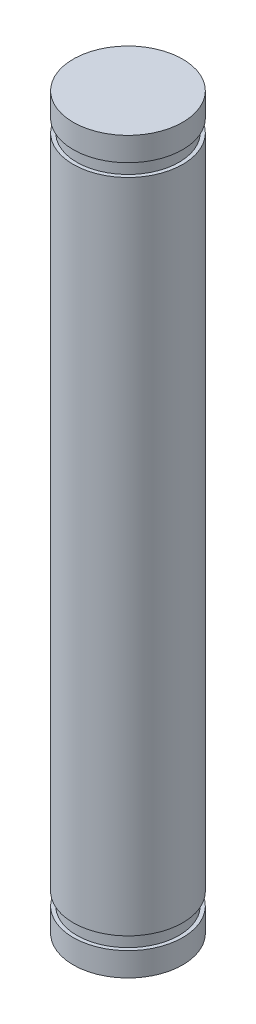
ISO-10303-21;
HEADER;
FILE_DESCRIPTION(('STEP AP214'),'2;1');
FILE_NAME('part.step','',(''),(''),'','','');
FILE_SCHEMA(('AUTOMOTIVE_DESIGN { 1 0 10303 214 1 1 1 1 }'));
ENDSEC;
DATA;
#1=APPLICATION_CONTEXT('core data for automotive mechanical design processes');
#2=APPLICATION_PROTOCOL_DEFINITION('international standard','automotive_design',2000,#1);
#3=PRODUCT_CONTEXT('',#1,'mechanical');
#4=PRODUCT('Part','Part','',(#3));
#5=PRODUCT_RELATED_PRODUCT_CATEGORY('part','',(#4));
#6=PRODUCT_DEFINITION_FORMATION('','',#4);
#7=PRODUCT_DEFINITION_CONTEXT('part definition',#1,'design');
#8=PRODUCT_DEFINITION('design','',#6,#7);
#9=PRODUCT_DEFINITION_SHAPE('','',#8);
#10=(LENGTH_UNIT() NAMED_UNIT(*) SI_UNIT(.MILLI.,.METRE.));
#11=(NAMED_UNIT(*) PLANE_ANGLE_UNIT() SI_UNIT($,.RADIAN.));
#12=(NAMED_UNIT(*) SI_UNIT($,.STERADIAN.) SOLID_ANGLE_UNIT());
#13=UNCERTAINTY_MEASURE_WITH_UNIT(LENGTH_MEASURE(1.E-05),#10,'distance_accuracy_value','');
#14=(GEOMETRIC_REPRESENTATION_CONTEXT(3) GLOBAL_UNCERTAINTY_ASSIGNED_CONTEXT((#13)) GLOBAL_UNIT_ASSIGNED_CONTEXT((#10,
#11,#12)) REPRESENTATION_CONTEXT('',''));
#15=CARTESIAN_POINT('',(0.,0.,0.));
#16=DIRECTION('',(0.,0.,1.));
#17=DIRECTION('',(1.,0.,0.));
#18=AXIS2_PLACEMENT_3D('',#15,#16,#17);
#19=CARTESIAN_POINT('',(0.,20.,0.));
#20=DIRECTION('',(0.,1.,0.));
#21=DIRECTION('',(0.,0.,1.));
#22=AXIS2_PLACEMENT_3D('',#19,#20,#21);
#23=CYLINDRICAL_SURFACE('',#22,2.99999999999999);
#24=CARTESIAN_POINT('',(0.,-18.7,0.));
#25=DIRECTION('',(0.,1.,0.));
#26=DIRECTION('',(0.,0.,1.));
#27=AXIS2_PLACEMENT_3D('',#24,#25,#26);
#28=CIRCLE('',#27,2.99999999999999);
#29=CARTESIAN_POINT('',(0.,-18.7,2.99999999999999));
#30=VERTEX_POINT('',#29);
#31=EDGE_CURVE('E12',#30,#30,#28,.T.);
#32=ORIENTED_EDGE('',*,*,#31,.F.);
#33=EDGE_LOOP('',(#32));
#34=FACE_BOUND('',#33,.T.);
#35=CARTESIAN_POINT('',(0.,-20.,0.));
#36=DIRECTION('',(0.,1.,0.));
#37=DIRECTION('',(0.,0.,1.));
#38=AXIS2_PLACEMENT_3D('',#35,#36,#37);
#39=CIRCLE('',#38,2.99999999999999);
#40=CARTESIAN_POINT('',(0.,-20.,2.99999999999999));
#41=VERTEX_POINT('',#40);
#42=EDGE_CURVE('E78',#41,#41,#39,.T.);
#43=ORIENTED_EDGE('',*,*,#42,.T.);
#44=EDGE_LOOP('',(#43));
#45=FACE_BOUND('',#44,.T.);
#46=ADVANCED_FACE('F44',(#34,#45),#23,.T.);
#47=CARTESIAN_POINT('',(2.99999999999999,-18.7,0.));
#48=DIRECTION('',(0.,-1.,0.));
#49=DIRECTION('',(0.,0.,-1.));
#50=AXIS2_PLACEMENT_3D('',#47,#48,#49);
#51=PLANE('',#50);
#52=CARTESIAN_POINT('',(0.,-18.7,0.));
#53=DIRECTION('',(0.,1.,0.));
#54=DIRECTION('',(0.,0.,1.));
#55=AXIS2_PLACEMENT_3D('',#52,#53,#54);
#56=CIRCLE('',#55,2.79999999999999);
#57=CARTESIAN_POINT('',(0.,-18.7,2.79999999999999));
#58=VERTEX_POINT('',#57);
#59=EDGE_CURVE('E50',#58,#58,#56,.T.);
#60=ORIENTED_EDGE('',*,*,#59,.F.);
#61=EDGE_LOOP('',(#60));
#62=FACE_BOUND('',#61,.T.);
#63=ORIENTED_EDGE('',*,*,#31,.T.);
#64=EDGE_LOOP('',(#63));
#65=FACE_BOUND('',#64,.T.);
#66=ADVANCED_FACE('F97',(#62,#65),#51,.F.);
#67=CARTESIAN_POINT('',(0.,20.,0.));
#68=DIRECTION('',(0.,1.,0.));
#69=DIRECTION('',(0.,0.,1.));
#70=AXIS2_PLACEMENT_3D('',#67,#68,#69);
#71=CYLINDRICAL_SURFACE('',#70,2.79999999999999);
#72=CARTESIAN_POINT('',(0.,-18.,0.));
#73=DIRECTION('',(0.,1.,0.));
#74=DIRECTION('',(0.,0.,1.));
#75=AXIS2_PLACEMENT_3D('',#72,#73,#74);
#76=CIRCLE('',#75,2.79999999999999);
#77=CARTESIAN_POINT('',(0.,-18.,2.79999999999999));
#78=VERTEX_POINT('',#77);
#79=EDGE_CURVE('E54',#78,#78,#76,.T.);
#80=ORIENTED_EDGE('',*,*,#79,.F.);
#81=EDGE_LOOP('',(#80));
#82=FACE_BOUND('',#81,.T.);
#83=ORIENTED_EDGE('',*,*,#59,.T.);
#84=EDGE_LOOP('',(#83));
#85=FACE_BOUND('',#84,.T.);
#86=ADVANCED_FACE('F102',(#82,#85),#71,.T.);
#87=CARTESIAN_POINT('',(2.79999999999999,-18.,0.));
#88=DIRECTION('',(0.,1.,0.));
#89=DIRECTION('',(0.,0.,1.));
#90=AXIS2_PLACEMENT_3D('',#87,#88,#89);
#91=PLANE('',#90);
#92=CARTESIAN_POINT('',(0.,-18.,0.));
#93=DIRECTION('',(0.,1.,0.));
#94=DIRECTION('',(0.,0.,1.));
#95=AXIS2_PLACEMENT_3D('',#92,#93,#94);
#96=CIRCLE('',#95,2.99999999999999);
#97=CARTESIAN_POINT('',(0.,-18.,2.99999999999999));
#98=VERTEX_POINT('',#97);
#99=EDGE_CURVE('E58',#98,#98,#96,.T.);
#100=ORIENTED_EDGE('',*,*,#99,.F.);
#101=EDGE_LOOP('',(#100));
#102=FACE_BOUND('',#101,.T.);
#103=ORIENTED_EDGE('',*,*,#79,.T.);
#104=EDGE_LOOP('',(#103));
#105=FACE_BOUND('',#104,.T.);
#106=ADVANCED_FACE('F107',(#102,#105),#91,.F.);
#107=CARTESIAN_POINT('',(0.,20.,0.));
#108=DIRECTION('',(0.,1.,0.));
#109=DIRECTION('',(0.,0.,1.));
#110=AXIS2_PLACEMENT_3D('',#107,#108,#109);
#111=CYLINDRICAL_SURFACE('',#110,3.);
#112=CARTESIAN_POINT('',(0.,18.,0.));
#113=DIRECTION('',(0.,1.,0.));
#114=DIRECTION('',(0.,0.,1.));
#115=AXIS2_PLACEMENT_3D('',#112,#113,#114);
#116=CIRCLE('',#115,3.);
#117=CARTESIAN_POINT('',(0.,18.,3.));
#118=VERTEX_POINT('',#117);
#119=EDGE_CURVE('E63',#118,#118,#116,.T.);
#120=ORIENTED_EDGE('',*,*,#119,.F.);
#121=EDGE_LOOP('',(#120));
#122=FACE_BOUND('',#121,.T.);
#123=ORIENTED_EDGE('',*,*,#99,.T.);
#124=EDGE_LOOP('',(#123));
#125=FACE_BOUND('',#124,.T.);
#126=ADVANCED_FACE('F113',(#122,#125),#111,.T.);
#127=CARTESIAN_POINT('',(3.,18.,0.));
#128=DIRECTION('',(0.,-1.,0.));
#129=DIRECTION('',(0.,0.,-1.));
#130=AXIS2_PLACEMENT_3D('',#127,#128,#129);
#131=PLANE('',#130);
#132=CARTESIAN_POINT('',(0.,18.,0.));
#133=DIRECTION('',(0.,1.,0.));
#134=DIRECTION('',(0.,0.,1.));
#135=AXIS2_PLACEMENT_3D('',#132,#133,#134);
#136=CIRCLE('',#135,2.8);
#137=CARTESIAN_POINT('',(0.,18.,2.8));
#138=VERTEX_POINT('',#137);
#139=EDGE_CURVE('E66',#138,#138,#136,.T.);
#140=ORIENTED_EDGE('',*,*,#139,.F.);
#141=EDGE_LOOP('',(#140));
#142=FACE_BOUND('',#141,.T.);
#143=ORIENTED_EDGE('',*,*,#119,.T.);
#144=EDGE_LOOP('',(#143));
#145=FACE_BOUND('',#144,.T.);
#146=ADVANCED_FACE('F117',(#142,#145),#131,.F.);
#147=CARTESIAN_POINT('',(0.,20.,0.));
#148=DIRECTION('',(0.,1.,0.));
#149=DIRECTION('',(0.,0.,1.));
#150=AXIS2_PLACEMENT_3D('',#147,#148,#149);
#151=CYLINDRICAL_SURFACE('',#150,2.79999999999999);
#152=CARTESIAN_POINT('',(0.,18.7,0.));
#153=DIRECTION('',(0.,1.,0.));
#154=DIRECTION('',(0.,0.,1.));
#155=AXIS2_PLACEMENT_3D('',#152,#153,#154);
#156=CIRCLE('',#155,2.79999999999999);
#157=CARTESIAN_POINT('',(0.,18.7,2.79999999999999));
#158=VERTEX_POINT('',#157);
#159=EDGE_CURVE('E69',#158,#158,#156,.T.);
#160=ORIENTED_EDGE('',*,*,#159,.F.);
#161=EDGE_LOOP('',(#160));
#162=FACE_BOUND('',#161,.T.);
#163=ORIENTED_EDGE('',*,*,#139,.T.);
#164=EDGE_LOOP('',(#163));
#165=FACE_BOUND('',#164,.T.);
#166=ADVANCED_FACE('F121',(#162,#165),#151,.T.);
#167=CARTESIAN_POINT('',(2.79999999999999,18.7,0.));
#168=DIRECTION('',(0.,1.,0.));
#169=DIRECTION('',(0.,0.,1.));
#170=AXIS2_PLACEMENT_3D('',#167,#168,#169);
#171=PLANE('',#170);
#172=CARTESIAN_POINT('',(0.,18.7,0.));
#173=DIRECTION('',(0.,1.,0.));
#174=DIRECTION('',(0.,0.,1.));
#175=AXIS2_PLACEMENT_3D('',#172,#173,#174);
#176=CIRCLE('',#175,3.);
#177=CARTESIAN_POINT('',(0.,18.7,3.));
#178=VERTEX_POINT('',#177);
#179=EDGE_CURVE('E72',#178,#178,#176,.T.);
#180=ORIENTED_EDGE('',*,*,#179,.F.);
#181=EDGE_LOOP('',(#180));
#182=FACE_BOUND('',#181,.T.);
#183=ORIENTED_EDGE('',*,*,#159,.T.);
#184=EDGE_LOOP('',(#183));
#185=FACE_BOUND('',#184,.T.);
#186=ADVANCED_FACE('F125',(#182,#185),#171,.F.);
#187=CARTESIAN_POINT('',(0.,20.,0.));
#188=DIRECTION('',(0.,1.,0.));
#189=DIRECTION('',(0.,0.,1.));
#190=AXIS2_PLACEMENT_3D('',#187,#188,#189);
#191=CYLINDRICAL_SURFACE('',#190,3.);
#192=CARTESIAN_POINT('',(0.,20.,0.));
#193=DIRECTION('',(0.,1.,0.));
#194=DIRECTION('',(0.,0.,1.));
#195=AXIS2_PLACEMENT_3D('',#192,#193,#194);
#196=CIRCLE('',#195,3.);
#197=CARTESIAN_POINT('',(0.,20.,3.));
#198=VERTEX_POINT('',#197);
#199=EDGE_CURVE('E75',#198,#198,#196,.T.);
#200=ORIENTED_EDGE('',*,*,#199,.F.);
#201=EDGE_LOOP('',(#200));
#202=FACE_BOUND('',#201,.T.);
#203=ORIENTED_EDGE('',*,*,#179,.T.);
#204=EDGE_LOOP('',(#203));
#205=FACE_BOUND('',#204,.T.);
#206=ADVANCED_FACE('F93',(#202,#205),#191,.T.);
#207=CARTESIAN_POINT('',(2.99999999999999,20.,0.));
#208=DIRECTION('',(0.,-1.,0.));
#209=DIRECTION('',(0.,0.,-1.));
#210=AXIS2_PLACEMENT_3D('',#207,#208,#209);
#211=PLANE('',#210);
#212=ORIENTED_EDGE('',*,*,#199,.T.);
#213=EDGE_LOOP('',(#212));
#214=FACE_BOUND('',#213,.T.);
#215=ADVANCED_FACE('F89',(#214),#211,.F.);
#216=CARTESIAN_POINT('',(0.,-20.,0.));
#217=DIRECTION('',(0.,1.,0.));
#218=DIRECTION('',(0.,0.,1.));
#219=AXIS2_PLACEMENT_3D('',#216,#217,#218);
#220=PLANE('',#219);
#221=ORIENTED_EDGE('',*,*,#42,.F.);
#222=EDGE_LOOP('',(#221));
#223=FACE_BOUND('',#222,.T.);
#224=ADVANCED_FACE('F87',(#223),#220,.F.);
#225=CLOSED_SHELL('',(#46,#66,#86,#106,#126,#146,#166,#186,#206,#215,#224));
#226=MANIFOLD_SOLID_BREP('B2',#225);
#227=ADVANCED_BREP_SHAPE_REPRESENTATION('',(#18,#226),#14);
#228=SHAPE_DEFINITION_REPRESENTATION(#9,#227);
ENDSEC;
END-ISO-10303-21;
